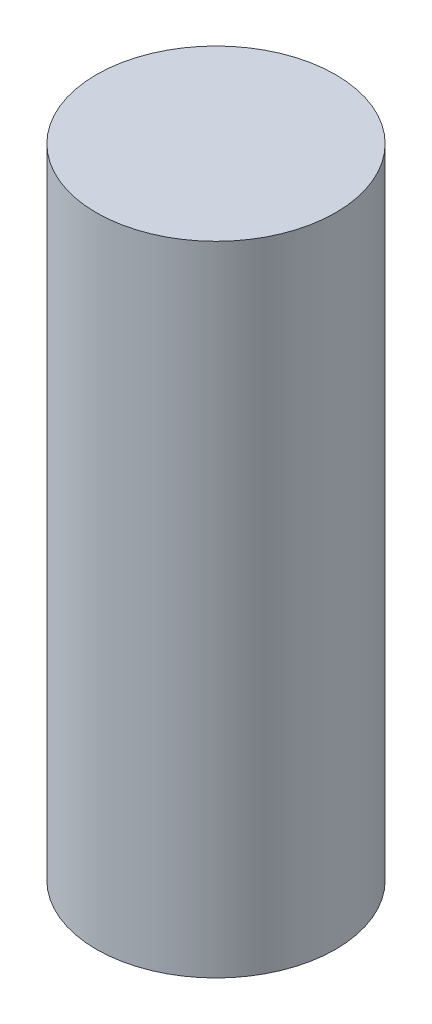
ISO-10303-21;
HEADER;
FILE_DESCRIPTION(('STEP AP214'),'2;1');
FILE_NAME('part.step','',(''),(''),'','','');
FILE_SCHEMA(('AUTOMOTIVE_DESIGN { 1 0 10303 214 1 1 1 1 }'));
ENDSEC;
DATA;
#1=APPLICATION_CONTEXT('core data for automotive mechanical design processes');
#2=APPLICATION_PROTOCOL_DEFINITION('international standard','automotive_design',2000,#1);
#3=PRODUCT_CONTEXT('',#1,'mechanical');
#4=PRODUCT('Part','Part','',(#3));
#5=PRODUCT_RELATED_PRODUCT_CATEGORY('part','',(#4));
#6=PRODUCT_DEFINITION_FORMATION('','',#4);
#7=PRODUCT_DEFINITION_CONTEXT('part definition',#1,'design');
#8=PRODUCT_DEFINITION('design','',#6,#7);
#9=PRODUCT_DEFINITION_SHAPE('','',#8);
#10=(LENGTH_UNIT() NAMED_UNIT(*) SI_UNIT(.MILLI.,.METRE.));
#11=(NAMED_UNIT(*) PLANE_ANGLE_UNIT() SI_UNIT($,.RADIAN.));
#12=(NAMED_UNIT(*) SI_UNIT($,.STERADIAN.) SOLID_ANGLE_UNIT());
#13=UNCERTAINTY_MEASURE_WITH_UNIT(LENGTH_MEASURE(1.E-05),#10,'distance_accuracy_value','');
#14=(GEOMETRIC_REPRESENTATION_CONTEXT(3) GLOBAL_UNCERTAINTY_ASSIGNED_CONTEXT((#13)) GLOBAL_UNIT_ASSIGNED_CONTEXT((#10,
#11,#12)) REPRESENTATION_CONTEXT('',''));
#15=CARTESIAN_POINT('',(0.,0.,0.));
#16=DIRECTION('',(0.,0.,1.));
#17=DIRECTION('',(1.,0.,0.));
#18=AXIS2_PLACEMENT_3D('',#15,#16,#17);
#19=CARTESIAN_POINT('',(0.,203.2,0.));
#20=DIRECTION('',(0.,-1.,0.));
#21=DIRECTION('',(0.,0.,-1.));
#22=AXIS2_PLACEMENT_3D('',#19,#20,#21);
#23=CYLINDRICAL_SURFACE('',#22,38.1);
#24=CARTESIAN_POINT('',(0.,203.2,0.));
#25=DIRECTION('',(0.,1.,0.));
#26=DIRECTION('',(0.,0.,1.));
#27=AXIS2_PLACEMENT_3D('',#24,#25,#26);
#28=CIRCLE('',#27,38.1);
#29=CARTESIAN_POINT('',(0.,203.2,38.1));
#30=VERTEX_POINT('',#29);
#31=EDGE_CURVE('E10',#30,#30,#28,.T.);
#32=ORIENTED_EDGE('',*,*,#31,.F.);
#33=EDGE_LOOP('',(#32));
#34=FACE_BOUND('',#33,.T.);
#35=CARTESIAN_POINT('',(0.,0.,0.));
#36=DIRECTION('',(0.,1.,0.));
#37=DIRECTION('',(0.,0.,1.));
#38=AXIS2_PLACEMENT_3D('',#35,#36,#37);
#39=CIRCLE('',#38,38.1);
#40=CARTESIAN_POINT('',(0.,0.,38.1));
#41=VERTEX_POINT('',#40);
#42=EDGE_CURVE('E34',#41,#41,#39,.T.);
#43=ORIENTED_EDGE('',*,*,#42,.T.);
#44=EDGE_LOOP('',(#43));
#45=FACE_BOUND('',#44,.T.);
#46=ADVANCED_FACE('F31',(#34,#45),#23,.T.);
#47=CARTESIAN_POINT('',(0.,203.2,0.));
#48=DIRECTION('',(0.,1.,0.));
#49=DIRECTION('',(0.,0.,1.));
#50=AXIS2_PLACEMENT_3D('',#47,#48,#49);
#51=PLANE('',#50);
#52=ORIENTED_EDGE('',*,*,#31,.T.);
#53=EDGE_LOOP('',(#52));
#54=FACE_BOUND('',#53,.T.);
#55=ADVANCED_FACE('F46',(#54),#51,.T.);
#56=CARTESIAN_POINT('',(0.,0.,0.));
#57=DIRECTION('',(0.,1.,0.));
#58=DIRECTION('',(0.,0.,1.));
#59=AXIS2_PLACEMENT_3D('',#56,#57,#58);
#60=PLANE('',#59);
#61=ORIENTED_EDGE('',*,*,#42,.F.);
#62=EDGE_LOOP('',(#61));
#63=FACE_BOUND('',#62,.T.);
#64=ADVANCED_FACE('F44',(#63),#60,.F.);
#65=CLOSED_SHELL('',(#46,#55,#64));
#66=MANIFOLD_SOLID_BREP('B2',#65);
#67=ADVANCED_BREP_SHAPE_REPRESENTATION('',(#18,#66),#14);
#68=SHAPE_DEFINITION_REPRESENTATION(#9,#67);
ENDSEC;
END-ISO-10303-21;
